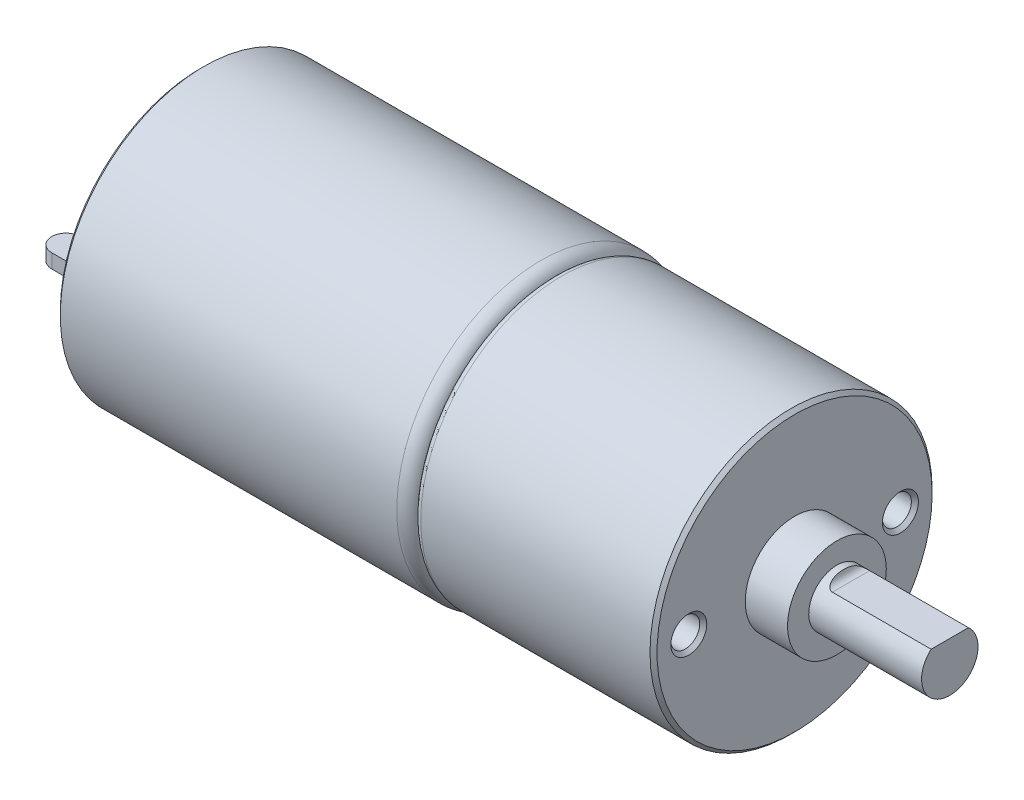
ISO-10303-21;
HEADER;
FILE_DESCRIPTION(('STEP AP214'),'2;1');
FILE_NAME('part.step','',(''),(''),'','','');
FILE_SCHEMA(('AUTOMOTIVE_DESIGN { 1 0 10303 214 1 1 1 1 }'));
ENDSEC;
DATA;
#1=APPLICATION_CONTEXT('core data for automotive mechanical design processes');
#2=APPLICATION_PROTOCOL_DEFINITION('international standard','automotive_design',2000,#1);
#3=PRODUCT_CONTEXT('',#1,'mechanical');
#4=PRODUCT('Part','Part','',(#3));
#5=PRODUCT_RELATED_PRODUCT_CATEGORY('part','',(#4));
#6=PRODUCT_DEFINITION_FORMATION('','',#4);
#7=PRODUCT_DEFINITION_CONTEXT('part definition',#1,'design');
#8=PRODUCT_DEFINITION('design','',#6,#7);
#9=PRODUCT_DEFINITION_SHAPE('','',#8);
#10=(LENGTH_UNIT() NAMED_UNIT(*) SI_UNIT(.MILLI.,.METRE.));
#11=(NAMED_UNIT(*) PLANE_ANGLE_UNIT() SI_UNIT($,.RADIAN.));
#12=(NAMED_UNIT(*) SI_UNIT($,.STERADIAN.) SOLID_ANGLE_UNIT());
#13=UNCERTAINTY_MEASURE_WITH_UNIT(LENGTH_MEASURE(1.E-05),#10,'distance_accuracy_value','');
#14=(GEOMETRIC_REPRESENTATION_CONTEXT(3) GLOBAL_UNCERTAINTY_ASSIGNED_CONTEXT((#13)) GLOBAL_UNIT_ASSIGNED_CONTEXT((#10,
#11,#12)) REPRESENTATION_CONTEXT('',''));
#15=CARTESIAN_POINT('',(0.,0.,0.));
#16=DIRECTION('',(0.,0.,1.));
#17=DIRECTION('',(1.,0.,0.));
#18=AXIS2_PLACEMENT_3D('',#15,#16,#17);
#19=CARTESIAN_POINT('',(0.,0.,0.));
#20=DIRECTION('',(1.,0.,0.));
#21=DIRECTION('',(0.,0.,-1.));
#22=AXIS2_PLACEMENT_3D('',#19,#20,#21);
#23=PLANE('',#22);
#24=DIRECTION('',(0.,-1.,0.));
#25=VECTOR('',#24,1.);
#26=CARTESIAN_POINT('',(0.,0.5,-7.15));
#27=LINE('',#26,#25);
#28=CARTESIAN_POINT('',(0.,0.5,-7.15));
#29=VERTEX_POINT('',#28);
#30=CARTESIAN_POINT('',(0.,-0.5,-7.15));
#31=VERTEX_POINT('',#30);
#32=EDGE_CURVE('E180',#29,#31,#27,.T.);
#33=ORIENTED_EDGE('',*,*,#32,.F.);
#34=DIRECTION('',(0.,0.,-1.));
#35=VECTOR('',#34,1.);
#36=CARTESIAN_POINT('',(0.,0.5,-7.15));
#37=LINE('',#36,#35);
#38=CARTESIAN_POINT('',(0.,0.5,-5.15));
#39=VERTEX_POINT('',#38);
#40=EDGE_CURVE('E192',#39,#29,#37,.T.);
#41=ORIENTED_EDGE('',*,*,#40,.F.);
#42=DIRECTION('',(0.,1.,0.));
#43=VECTOR('',#42,1.);
#44=CARTESIAN_POINT('',(0.,0.5,-5.15));
#45=LINE('',#44,#43);
#46=CARTESIAN_POINT('',(0.,-0.5,-5.15));
#47=VERTEX_POINT('',#46);
#48=EDGE_CURVE('E188',#47,#39,#45,.T.);
#49=ORIENTED_EDGE('',*,*,#48,.F.);
#50=DIRECTION('',(0.,0.,1.));
#51=VECTOR('',#50,1.);
#52=CARTESIAN_POINT('',(0.,-0.5,-7.15));
#53=LINE('',#52,#51);
#54=EDGE_CURVE('E184',#31,#47,#53,.T.);
#55=ORIENTED_EDGE('',*,*,#54,.F.);
#56=EDGE_LOOP('',(#33,#41,#49,#55));
#57=FACE_BOUND('',#56,.T.);
#58=CARTESIAN_POINT('',(0.,0.,0.));
#59=DIRECTION('',(1.,0.,0.));
#60=DIRECTION('',(0.,0.,-1.));
#61=AXIS2_PLACEMENT_3D('',#58,#59,#60);
#62=CIRCLE('',#61,9.95);
#63=CARTESIAN_POINT('',(0.,0.,-9.95));
#64=VERTEX_POINT('',#63);
#65=EDGE_CURVE('E259',#64,#64,#62,.F.);
#66=ORIENTED_EDGE('',*,*,#65,.T.);
#67=EDGE_LOOP('',(#66));
#68=FACE_BOUND('',#67,.T.);
#69=DIRECTION('',(0.,-1.,0.));
#70=VECTOR('',#69,1.);
#71=CARTESIAN_POINT('',(0.,0.5,5.15));
#72=LINE('',#71,#70);
#73=CARTESIAN_POINT('',(0.,0.5,5.15));
#74=VERTEX_POINT('',#73);
#75=CARTESIAN_POINT('',(0.,-0.5,5.15));
#76=VERTEX_POINT('',#75);
#77=EDGE_CURVE('E143',#74,#76,#72,.T.);
#78=ORIENTED_EDGE('',*,*,#77,.F.);
#79=DIRECTION('',(0.,0.,-1.));
#80=VECTOR('',#79,1.);
#81=CARTESIAN_POINT('',(0.,0.5,5.15));
#82=LINE('',#81,#80);
#83=CARTESIAN_POINT('',(0.,0.5,7.15));
#84=VERTEX_POINT('',#83);
#85=EDGE_CURVE('E151',#84,#74,#82,.T.);
#86=ORIENTED_EDGE('',*,*,#85,.F.);
#87=DIRECTION('',(0.,1.,0.));
#88=VECTOR('',#87,1.);
#89=CARTESIAN_POINT('',(0.,0.5,7.15));
#90=LINE('',#89,#88);
#91=CARTESIAN_POINT('',(0.,-0.5,7.15));
#92=VERTEX_POINT('',#91);
#93=EDGE_CURVE('E166',#92,#84,#90,.T.);
#94=ORIENTED_EDGE('',*,*,#93,.F.);
#95=DIRECTION('',(0.,0.,1.));
#96=VECTOR('',#95,1.);
#97=CARTESIAN_POINT('',(0.,-0.5,5.15));
#98=LINE('',#97,#96);
#99=EDGE_CURVE('E159',#76,#92,#98,.T.);
#100=ORIENTED_EDGE('',*,*,#99,.F.);
#101=EDGE_LOOP('',(#78,#86,#94,#100));
#102=FACE_BOUND('',#101,.T.);
#103=ADVANCED_FACE('F45',(#57,#68,#102),#23,.F.);
#104=CARTESIAN_POINT('',(25.1,0.,0.));
#105=DIRECTION('',(-1.,0.,0.));
#106=DIRECTION('',(0.,0.,1.));
#107=AXIS2_PLACEMENT_3D('',#104,#105,#106);
#108=CYLINDRICAL_SURFACE('',#107,10.2);
#109=CARTESIAN_POINT('',(0.249999999999997,0.,0.));
#110=DIRECTION('',(1.,0.,0.));
#111=DIRECTION('',(0.,0.,-1.));
#112=AXIS2_PLACEMENT_3D('',#109,#110,#111);
#113=CIRCLE('',#112,10.2);
#114=CARTESIAN_POINT('',(0.249999999999997,0.,-10.2));
#115=VERTEX_POINT('',#114);
#116=EDGE_CURVE('E283',#115,#115,#113,.T.);
#117=ORIENTED_EDGE('',*,*,#116,.T.);
#118=EDGE_LOOP('',(#117));
#119=FACE_BOUND('',#118,.T.);
#120=CARTESIAN_POINT('',(24.1,0.,0.));
#121=DIRECTION('',(1.,0.,0.));
#122=DIRECTION('',(0.,0.,-1.));
#123=AXIS2_PLACEMENT_3D('',#120,#121,#122);
#124=CIRCLE('',#123,10.2);
#125=CARTESIAN_POINT('',(24.1,0.,-10.2));
#126=VERTEX_POINT('',#125);
#127=EDGE_CURVE('E263',#126,#126,#124,.F.);
#128=ORIENTED_EDGE('',*,*,#127,.T.);
#129=EDGE_LOOP('',(#128));
#130=FACE_BOUND('',#129,.T.);
#131=ADVANCED_FACE('F328',(#119,#130),#108,.T.);
#132=CARTESIAN_POINT('',(24.1,0.,0.));
#133=DIRECTION('',(1.,0.,0.));
#134=DIRECTION('',(0.,0.,-1.));
#135=AXIS2_PLACEMENT_3D('',#132,#133,#134);
#136=TOROIDAL_SURFACE('',#135,9.2,1.);
#137=ORIENTED_EDGE('',*,*,#127,.F.);
#138=EDGE_LOOP('',(#137));
#139=FACE_BOUND('',#138,.T.);
#140=CARTESIAN_POINT('',(25.1,0.,0.));
#141=DIRECTION('',(1.,0.,0.));
#142=DIRECTION('',(0.,0.,-1.));
#143=AXIS2_PLACEMENT_3D('',#140,#141,#142);
#144=CIRCLE('',#143,9.2);
#145=CARTESIAN_POINT('',(25.1,0.,-9.2));
#146=VERTEX_POINT('',#145);
#147=EDGE_CURVE('E253',#146,#146,#144,.T.);
#148=ORIENTED_EDGE('',*,*,#147,.F.);
#149=EDGE_LOOP('',(#148));
#150=FACE_BOUND('',#149,.T.);
#151=ADVANCED_FACE('F334',(#139,#150),#136,.T.);
#152=CARTESIAN_POINT('',(42.1,0.,0.));
#153=DIRECTION('',(-1.,0.,0.));
#154=DIRECTION('',(0.,0.,1.));
#155=AXIS2_PLACEMENT_3D('',#152,#153,#154);
#156=CYLINDRICAL_SURFACE('',#155,10.);
#157=CARTESIAN_POINT('',(41.85,0.,0.));
#158=DIRECTION('',(1.,0.,0.));
#159=DIRECTION('',(0.,0.,-1.));
#160=AXIS2_PLACEMENT_3D('',#157,#158,#159);
#161=CIRCLE('',#160,10.);
#162=CARTESIAN_POINT('',(41.85,0.,-10.));
#163=VERTEX_POINT('',#162);
#164=EDGE_CURVE('E279',#163,#163,#161,.F.);
#165=ORIENTED_EDGE('',*,*,#164,.T.);
#166=EDGE_LOOP('',(#165));
#167=FACE_BOUND('',#166,.T.);
#168=CARTESIAN_POINT('',(25.6,0.,0.));
#169=DIRECTION('',(1.,0.,0.));
#170=DIRECTION('',(0.,0.,-1.));
#171=AXIS2_PLACEMENT_3D('',#168,#169,#170);
#172=CIRCLE('',#171,10.);
#173=CARTESIAN_POINT('',(25.6,0.,-10.));
#174=VERTEX_POINT('',#173);
#175=EDGE_CURVE('E267',#174,#174,#172,.T.);
#176=ORIENTED_EDGE('',*,*,#175,.T.);
#177=EDGE_LOOP('',(#176));
#178=FACE_BOUND('',#177,.T.);
#179=ADVANCED_FACE('F340',(#167,#178),#156,.T.);
#180=CARTESIAN_POINT('',(42.1,0.,0.));
#181=DIRECTION('',(1.,0.,0.));
#182=DIRECTION('',(0.,0.,-1.));
#183=AXIS2_PLACEMENT_3D('',#180,#181,#182);
#184=PLANE('',#183);
#185=CARTESIAN_POINT('',(42.1,0.,7.5));
#186=DIRECTION('',(1.,0.,0.));
#187=DIRECTION('',(0.,0.,-1.));
#188=AXIS2_PLACEMENT_3D('',#185,#186,#187);
#189=CIRCLE('',#188,1.275);
#190=CARTESIAN_POINT('',(42.1,0.,6.225));
#191=VERTEX_POINT('',#190);
#192=EDGE_CURVE('E208',#191,#191,#189,.T.);
#193=ORIENTED_EDGE('',*,*,#192,.F.);
#194=EDGE_LOOP('',(#193));
#195=FACE_BOUND('',#194,.T.);
#196=CARTESIAN_POINT('',(42.1,0.,-7.5));
#197=DIRECTION('',(1.,0.,0.));
#198=DIRECTION('',(0.,0.,-1.));
#199=AXIS2_PLACEMENT_3D('',#196,#197,#198);
#200=CIRCLE('',#199,1.275);
#201=CARTESIAN_POINT('',(42.1,0.,-8.775));
#202=VERTEX_POINT('',#201);
#203=EDGE_CURVE('E220',#202,#202,#200,.T.);
#204=ORIENTED_EDGE('',*,*,#203,.F.);
#205=EDGE_LOOP('',(#204));
#206=FACE_BOUND('',#205,.T.);
#207=CARTESIAN_POINT('',(42.1,0.,0.));
#208=DIRECTION('',(1.,0.,0.));
#209=DIRECTION('',(0.,0.,-1.));
#210=AXIS2_PLACEMENT_3D('',#207,#208,#209);
#211=CIRCLE('',#210,3.5);
#212=CARTESIAN_POINT('',(42.1,0.,-3.5));
#213=VERTEX_POINT('',#212);
#214=EDGE_CURVE('E254',#213,#213,#211,.T.);
#215=ORIENTED_EDGE('',*,*,#214,.F.);
#216=EDGE_LOOP('',(#215));
#217=FACE_BOUND('',#216,.T.);
#218=CARTESIAN_POINT('',(42.1,0.,0.));
#219=DIRECTION('',(1.,0.,0.));
#220=DIRECTION('',(0.,0.,-1.));
#221=AXIS2_PLACEMENT_3D('',#218,#219,#220);
#222=CIRCLE('',#221,9.74999999999999);
#223=CARTESIAN_POINT('',(42.1,0.,-9.74999999999999));
#224=VERTEX_POINT('',#223);
#225=EDGE_CURVE('E275',#224,#224,#222,.T.);
#226=ORIENTED_EDGE('',*,*,#225,.T.);
#227=EDGE_LOOP('',(#226));
#228=FACE_BOUND('',#227,.T.);
#229=ADVANCED_FACE('F491',(#195,#206,#217,#228),#184,.T.);
#230=CARTESIAN_POINT('',(25.1,0.,0.));
#231=DIRECTION('',(1.,0.,0.));
#232=DIRECTION('',(0.,0.,-1.));
#233=AXIS2_PLACEMENT_3D('',#230,#231,#232);
#234=PLANE('',#233);
#235=CARTESIAN_POINT('',(25.1,0.,0.));
#236=DIRECTION('',(1.,0.,0.));
#237=DIRECTION('',(0.,0.,-1.));
#238=AXIS2_PLACEMENT_3D('',#235,#236,#237);
#239=CIRCLE('',#238,9.5);
#240=CARTESIAN_POINT('',(25.1,0.,-9.5));
#241=VERTEX_POINT('',#240);
#242=EDGE_CURVE('E271',#241,#241,#239,.F.);
#243=ORIENTED_EDGE('',*,*,#242,.T.);
#244=EDGE_LOOP('',(#243));
#245=FACE_BOUND('',#244,.T.);
#246=ORIENTED_EDGE('',*,*,#147,.T.);
#247=EDGE_LOOP('',(#246));
#248=FACE_BOUND('',#247,.T.);
#249=ADVANCED_FACE('F350',(#245,#248),#234,.F.);
#250=CARTESIAN_POINT('',(25.6,0.,0.));
#251=DIRECTION('',(1.,0.,0.));
#252=DIRECTION('',(0.,0.,-1.));
#253=AXIS2_PLACEMENT_3D('',#250,#251,#252);
#254=TOROIDAL_SURFACE('',#253,9.5,0.5);
#255=ORIENTED_EDGE('',*,*,#242,.F.);
#256=EDGE_LOOP('',(#255));
#257=FACE_BOUND('',#256,.T.);
#258=ORIENTED_EDGE('',*,*,#175,.F.);
#259=EDGE_LOOP('',(#258));
#260=FACE_BOUND('',#259,.T.);
#261=ADVANCED_FACE('F346',(#257,#260),#254,.T.);
#262=CARTESIAN_POINT('',(42.1,0.,0.));
#263=DIRECTION('',(-1.,0.,0.));
#264=DIRECTION('',(0.,0.,1.));
#265=AXIS2_PLACEMENT_3D('',#262,#263,#264);
#266=CONICAL_SURFACE('',#265,9.74999999999999,0.785398163397445);
#267=ORIENTED_EDGE('',*,*,#164,.F.);
#268=EDGE_LOOP('',(#267));
#269=FACE_BOUND('',#268,.T.);
#270=ORIENTED_EDGE('',*,*,#225,.F.);
#271=EDGE_LOOP('',(#270));
#272=FACE_BOUND('',#271,.T.);
#273=ADVANCED_FACE('F349',(#269,#272),#266,.T.);
#274=CARTESIAN_POINT('',(0.249999999999997,0.,0.));
#275=DIRECTION('',(1.,0.,0.));
#276=DIRECTION('',(0.,0.,-1.));
#277=AXIS2_PLACEMENT_3D('',#274,#275,#276);
#278=CONICAL_SURFACE('',#277,10.2,0.785398163397452);
#279=ORIENTED_EDGE('',*,*,#65,.F.);
#280=EDGE_LOOP('',(#279));
#281=FACE_BOUND('',#280,.T.);
#282=ORIENTED_EDGE('',*,*,#116,.F.);
#283=EDGE_LOOP('',(#282));
#284=FACE_BOUND('',#283,.T.);
#285=ADVANCED_FACE('F358',(#281,#284),#278,.T.);
#286=CARTESIAN_POINT('',(45.1,0.,0.));
#287=DIRECTION('',(-1.,0.,0.));
#288=DIRECTION('',(0.,0.,1.));
#289=AXIS2_PLACEMENT_3D('',#286,#287,#288);
#290=CYLINDRICAL_SURFACE('',#289,3.5);
#291=CARTESIAN_POINT('',(45.1,0.,0.));
#292=DIRECTION('',(1.,0.,0.));
#293=DIRECTION('',(0.,0.,-1.));
#294=AXIS2_PLACEMENT_3D('',#291,#292,#293);
#295=CIRCLE('',#294,3.5);
#296=CARTESIAN_POINT('',(45.1,0.,-3.5));
#297=VERTEX_POINT('',#296);
#298=EDGE_CURVE('E249',#297,#297,#295,.T.);
#299=ORIENTED_EDGE('',*,*,#298,.F.);
#300=EDGE_LOOP('',(#299));
#301=FACE_BOUND('',#300,.T.);
#302=ORIENTED_EDGE('',*,*,#214,.T.);
#303=EDGE_LOOP('',(#302));
#304=FACE_BOUND('',#303,.T.);
#305=ADVANCED_FACE('F364',(#301,#304),#290,.T.);
#306=CARTESIAN_POINT('',(45.1,0.,0.));
#307=DIRECTION('',(1.,0.,0.));
#308=DIRECTION('',(0.,0.,-1.));
#309=AXIS2_PLACEMENT_3D('',#306,#307,#308);
#310=PLANE('',#309);
#311=CARTESIAN_POINT('',(45.1,0.,0.));
#312=DIRECTION('',(1.,0.,0.));
#313=DIRECTION('',(0.,0.,-1.));
#314=AXIS2_PLACEMENT_3D('',#311,#312,#313);
#315=CIRCLE('',#314,2.);
#316=CARTESIAN_POINT('',(45.1,0.,-2.));
#317=VERTEX_POINT('',#316);
#318=EDGE_CURVE('E248',#317,#317,#315,.F.);
#319=ORIENTED_EDGE('',*,*,#318,.T.);
#320=EDGE_LOOP('',(#319));
#321=FACE_BOUND('',#320,.T.);
#322=ORIENTED_EDGE('',*,*,#298,.T.);
#323=EDGE_LOOP('',(#322));
#324=FACE_BOUND('',#323,.T.);
#325=ADVANCED_FACE('F324',(#321,#324),#310,.T.);
#326=CARTESIAN_POINT('',(53.1,0.,0.));
#327=DIRECTION('',(-1.,0.,0.));
#328=DIRECTION('',(0.,0.,1.));
#329=AXIS2_PLACEMENT_3D('',#326,#327,#328);
#330=CYLINDRICAL_SURFACE('',#329,2.);
#331=ORIENTED_EDGE('',*,*,#318,.F.);
#332=EDGE_LOOP('',(#331));
#333=FACE_BOUND('',#332,.T.);
#334=CARTESIAN_POINT('',(53.1,0.,0.));
#335=DIRECTION('',(1.,0.,0.));
#336=DIRECTION('',(0.,0.,-1.));
#337=AXIS2_PLACEMENT_3D('',#334,#335,#336);
#338=CIRCLE('',#337,2.);
#339=CARTESIAN_POINT('',(53.1,1.5,1.3228756555323));
#340=VERTEX_POINT('',#339);
#341=CARTESIAN_POINT('',(53.1,1.5,-1.32287565553229));
#342=VERTEX_POINT('',#341);
#343=EDGE_CURVE('E244',#340,#342,#338,.T.);
#344=ORIENTED_EDGE('',*,*,#343,.F.);
#345=DIRECTION('',(-1.,0.,0.));
#346=VECTOR('',#345,1.);
#347=CARTESIAN_POINT('',(53.1,1.5,1.3228756555323));
#348=LINE('',#347,#346);
#349=CARTESIAN_POINT('',(46.1,1.5,1.32287565553229));
#350=VERTEX_POINT('',#349);
#351=EDGE_CURVE('E240',#340,#350,#348,.T.);
#352=ORIENTED_EDGE('',*,*,#351,.T.);
#353=CARTESIAN_POINT('',(46.1,1.5,1.3228756555323));
#354=CARTESIAN_POINT('',(46.0791676048181,1.49996270829361,1.32290249420377));
#355=CARTESIAN_POINT('',(46.0583774712538,1.5012996776808,1.32140225414852));
#356=CARTESIAN_POINT('',(46.0176633992575,1.50641290602934,1.31557799865092));
#357=CARTESIAN_POINT('',(45.9977340385252,1.51017036959621,1.31127573837705));
#358=CARTESIAN_POINT('',(45.9592225738211,1.5198142182921,1.30008279941611));
#359=CARTESIAN_POINT('',(45.940637883934,1.52569637937861,1.29319725542917));
#360=CARTESIAN_POINT('',(45.9051162884324,1.5391512831788,1.27715462877048));
#361=CARTESIAN_POINT('',(45.8881823959056,1.54672703708844,1.26799349685521));
#362=CARTESIAN_POINT('',(45.8506567353127,1.56593470640666,1.24424761482085));
#363=CARTESIAN_POINT('',(45.830815513438,1.57806473672201,1.2288817808771));
#364=CARTESIAN_POINT('',(45.7945122350983,1.60355160648134,1.19543615521496));
#365=CARTESIAN_POINT('',(45.7780561587593,1.61691055769274,1.17735165663688));
#366=CARTESIAN_POINT('',(45.7410811262295,1.6506133129931,1.12989973646012));
#367=CARTESIAN_POINT('',(45.7224154280413,1.67122598684686,1.09928938512504));
#368=CARTESIAN_POINT('',(45.6905948442696,1.71180790590734,1.03497435795543));
#369=CARTESIAN_POINT('',(45.6774511772054,1.7317757659124,1.00126355089678));
#370=CARTESIAN_POINT('',(45.6569802954824,1.76742323512638,0.936683318997856));
#371=CARTESIAN_POINT('',(45.6490896000934,1.78330739197099,0.906098595528337));
#372=CARTESIAN_POINT('',(45.6357256085982,1.8136581226407,0.843712563142041));
#373=CARTESIAN_POINT('',(45.630254049664,1.8281236719877,0.811910397733955));
#374=CARTESIAN_POINT('',(45.6165530086807,1.86915286590439,0.71497215597942));
#375=CARTESIAN_POINT('',(45.6110655074245,1.89329072603512,0.648409297327984));
#376=CARTESIAN_POINT('',(45.6047067881272,1.9297286656087,0.528353340784739));
#377=CARTESIAN_POINT('',(45.6030718092089,1.94347154559898,0.475312314202791));
#378=CARTESIAN_POINT('',(45.6009824735348,1.96657218874064,0.368226654670982));
#379=CARTESIAN_POINT('',(45.6005286562206,1.97592794667592,0.314181574509483));
#380=CARTESIAN_POINT('',(45.6000460868047,1.99017285948387,0.205476388621387));
#381=CARTESIAN_POINT('',(45.6000175901701,1.99505932824247,0.150815932993623));
#382=CARTESIAN_POINT('',(45.5999930623057,2.0003249582883,0.041289255187699));
#383=CARTESIAN_POINT('',(45.5999970240911,2.00070508925144,-0.0135769201816983));
#384=CARTESIAN_POINT('',(45.6000057598513,1.99693497650901,-0.12380697291298));
#385=CARTESIAN_POINT('',(45.6000105429255,1.99273079621824,-0.179169008437155));
#386=CARTESIAN_POINT('',(45.6003686482253,1.97973307110601,-0.289372156267123));
#387=CARTESIAN_POINT('',(45.6007220962038,1.97093787098128,-0.344213073416018));
#388=CARTESIAN_POINT('',(45.6024997215303,1.94885454708979,-0.452798486259084));
#389=CARTESIAN_POINT('',(45.6039206925356,1.9355799430059,-0.506545771189119));
#390=CARTESIAN_POINT('',(45.6089235585044,1.90465921593685,-0.612633932835227));
#391=CARTESIAN_POINT('',(45.6125034850658,1.88701708362049,-0.664976045349146));
#392=CARTESIAN_POINT('',(45.6226480931905,1.85016240475368,-0.761046514597283));
#393=CARTESIAN_POINT('',(45.6287653993129,1.83145036695579,-0.805011532569508));
#394=CARTESIAN_POINT('',(45.6451623181654,1.79120346558065,-0.890977617531939));
#395=CARTESIAN_POINT('',(45.6554492486227,1.76966368445761,-0.932975086145193));
#396=CARTESIAN_POINT('',(45.6821188043515,1.72416297852539,-1.01463260895081));
#397=CARTESIAN_POINT('',(45.6985965829306,1.70016875285907,-1.0542443498618));
#398=CARTESIAN_POINT('',(45.7398383699762,1.65174268284699,-1.1285726625121));
#399=CARTESIAN_POINT('',(45.7645514928599,1.62731437728351,-1.16331747857783));
#400=CARTESIAN_POINT('',(45.8088959316785,1.59306647210002,-1.20934125653485));
#401=CARTESIAN_POINT('',(45.8246673011653,1.58216243347284,-1.22353649858872));
#402=CARTESIAN_POINT('',(45.8587440303048,1.5616038670198,-1.24966657630222));
#403=CARTESIAN_POINT('',(45.8770494067039,1.55194934745248,-1.26160139702212));
#404=CARTESIAN_POINT('',(45.916273039465,1.53447886420174,-1.28279655804064));
#405=CARTESIAN_POINT('',(45.9372175597173,1.52668404930056,-1.29202638371135));
#406=CARTESIAN_POINT('',(45.9810638358131,1.51381887123397,-1.30707768906668));
#407=CARTESIAN_POINT('',(46.0039604476192,1.50874158942976,-1.31290782752668));
#408=CARTESIAN_POINT('',(46.0392960805606,1.50355156446553,-1.31884014315598));
#409=CARTESIAN_POINT('',(46.0513420459941,1.50222528495455,-1.32034921305609));
#410=CARTESIAN_POINT('',(46.0755885837809,1.50044785403216,-1.3223679528762));
#411=CARTESIAN_POINT('',(46.0877892474329,1.49999724616737,-1.32287700206577));
#412=CARTESIAN_POINT('',(46.1,1.5,-1.3228756555323));
#413=B_SPLINE_CURVE_WITH_KNOTS('',3,(#353,#354,#355,#356,#357,#358,#359,#360,#361,#362,#363,
#364,#365,#366,#367,#368,#369,#370,#371,#372,#373,#374,#375,#376,#377,#378,#379,#380,#381,#382,
#383,#384,#385,#386,#387,#388,#389,#390,#391,#392,#393,#394,#395,#396,#397,#398,#399,#400,#401,
#402,#403,#404,#405,#406,#407,#408,#409,#410,#411,#412),.UNSPECIFIED.,.F.,.F.,(4,2,2,2,2,2,2,2,
2,2,2,2,2,2,2,2,2,2,2,2,2,2,2,2,2,2,2,2,2,4),(0.,0.0623335339048153,0.124188782310098,
0.185921729085364,0.247765322113473,0.33092148753271,0.414223316644069,0.53759480450994,
0.661215734984689,0.767128608245249,0.873117414064848,1.08546121459961,1.24973964330858,
1.41409308553004,1.57854524200633,1.74296201094727,1.90933429979707,2.07576661605284,
2.24170103564787,2.40748439475189,2.55176434443078,2.69629861068146,2.8431518332843,
2.98911398483377,3.06046318830158,3.13181286331879,3.20393890799786,3.27588044094045,
3.31245211312006,3.34904647881489),.UNSPECIFIED.);
#414=CARTESIAN_POINT('',(46.1,1.5,-1.32287565553229));
#415=VERTEX_POINT('',#414);
#416=EDGE_CURVE('E295',#350,#415,#413,.T.);
#417=ORIENTED_EDGE('',*,*,#416,.T.);
#418=DIRECTION('',(-1.,0.,0.));
#419=VECTOR('',#418,1.);
#420=CARTESIAN_POINT('',(53.1,1.5,-1.3228756555323));
#421=LINE('',#420,#419);
#422=EDGE_CURVE('E236',#415,#342,#421,.F.);
#423=ORIENTED_EDGE('',*,*,#422,.T.);
#424=EDGE_LOOP('',(#344,#352,#417,#423));
#425=FACE_BOUND('',#424,.T.);
#426=ADVANCED_FACE('F307',(#333,#425),#330,.T.);
#427=CARTESIAN_POINT('',(53.1,0.,0.));
#428=DIRECTION('',(1.,0.,0.));
#429=DIRECTION('',(0.,0.,-1.));
#430=AXIS2_PLACEMENT_3D('',#427,#428,#429);
#431=PLANE('',#430);
#432=DIRECTION('',(0.,0.,-1.));
#433=VECTOR('',#432,1.);
#434=CARTESIAN_POINT('',(53.1,1.5,0.));
#435=LINE('',#434,#433);
#436=EDGE_CURVE('E258',#340,#342,#435,.T.);
#437=ORIENTED_EDGE('',*,*,#436,.F.);
#438=ORIENTED_EDGE('',*,*,#343,.T.);
#439=EDGE_LOOP('',(#437,#438));
#440=FACE_BOUND('',#439,.T.);
#441=ADVANCED_FACE('F316',(#440),#431,.T.);
#442=CARTESIAN_POINT('',(46.1,2.,-10.2));
#443=DIRECTION('',(0.,0.,1.));
#444=DIRECTION('',(1.,0.,0.));
#445=AXIS2_PLACEMENT_3D('',#442,#443,#444);
#446=CYLINDRICAL_SURFACE('',#445,0.5);
#447=DIRECTION('',(0.,0.,1.));
#448=VECTOR('',#447,1.);
#449=CARTESIAN_POINT('',(46.1,1.5,-10.2));
#450=LINE('',#449,#448);
#451=EDGE_CURVE('E232',#415,#350,#450,.T.);
#452=ORIENTED_EDGE('',*,*,#451,.F.);
#453=ORIENTED_EDGE('',*,*,#416,.F.);
#454=EDGE_LOOP('',(#452,#453));
#455=FACE_BOUND('',#454,.T.);
#456=ADVANCED_FACE('F311',(#455),#446,.F.);
#457=CARTESIAN_POINT('',(53.1,1.5,-10.2));
#458=DIRECTION('',(0.,-1.,0.));
#459=DIRECTION('',(1.,0.,0.));
#460=AXIS2_PLACEMENT_3D('',#457,#458,#459);
#461=PLANE('',#460);
#462=ORIENTED_EDGE('',*,*,#436,.T.);
#463=ORIENTED_EDGE('',*,*,#422,.F.);
#464=ORIENTED_EDGE('',*,*,#451,.T.);
#465=ORIENTED_EDGE('',*,*,#351,.F.);
#466=EDGE_LOOP('',(#462,#463,#464,#465));
#467=FACE_BOUND('',#466,.T.);
#468=ADVANCED_FACE('F315',(#467),#461,.F.);
#469=CARTESIAN_POINT('',(37.1,0.,-7.5));
#470=DIRECTION('',(1.,0.,0.));
#471=DIRECTION('',(0.,0.,-1.));
#472=AXIS2_PLACEMENT_3D('',#469,#470,#471);
#473=CONICAL_SURFACE('',#472,1.02499999999999,1.02974425867665);
#474=CARTESIAN_POINT('',(36.4841178654968,0.,-7.5));
#475=VERTEX_POINT('',#474);
#476=VERTEX_LOOP('',#475);
#477=FACE_BOUND('',#476,.T.);
#478=CARTESIAN_POINT('',(37.1,0.,-7.5));
#479=DIRECTION('',(1.,0.,0.));
#480=DIRECTION('',(0.,0.,-1.));
#481=AXIS2_PLACEMENT_3D('',#478,#479,#480);
#482=CIRCLE('',#481,1.02499999999999);
#483=CARTESIAN_POINT('',(37.1,0.,-8.525));
#484=VERTEX_POINT('',#483);
#485=EDGE_CURVE('E228',#484,#484,#482,.T.);
#486=ORIENTED_EDGE('',*,*,#485,.T.);
#487=EDGE_LOOP('',(#486));
#488=FACE_BOUND('',#487,.T.);
#489=ADVANCED_FACE('F476',(#477,#488),#473,.F.);
#490=CARTESIAN_POINT('',(42.1,0.,-7.5));
#491=DIRECTION('',(1.,0.,0.));
#492=DIRECTION('',(0.,0.,-1.));
#493=AXIS2_PLACEMENT_3D('',#490,#491,#492);
#494=CYLINDRICAL_SURFACE('',#493,1.02499999999999);
#495=ORIENTED_EDGE('',*,*,#485,.F.);
#496=EDGE_LOOP('',(#495));
#497=FACE_BOUND('',#496,.T.);
#498=CARTESIAN_POINT('',(41.85,0.,-7.5));
#499=DIRECTION('',(1.,0.,0.));
#500=DIRECTION('',(0.,0.,-1.));
#501=AXIS2_PLACEMENT_3D('',#498,#499,#500);
#502=CIRCLE('',#501,1.02499999999999);
#503=CARTESIAN_POINT('',(41.85,0.,-8.525));
#504=VERTEX_POINT('',#503);
#505=EDGE_CURVE('E224',#504,#504,#502,.T.);
#506=ORIENTED_EDGE('',*,*,#505,.T.);
#507=EDGE_LOOP('',(#506));
#508=FACE_BOUND('',#507,.T.);
#509=ADVANCED_FACE('F473',(#497,#508),#494,.F.);
#510=CARTESIAN_POINT('',(42.1,0.,-7.5));
#511=DIRECTION('',(1.,0.,0.));
#512=DIRECTION('',(0.,0.,-1.));
#513=AXIS2_PLACEMENT_3D('',#510,#511,#512);
#514=CONICAL_SURFACE('',#513,1.275,0.785398163397459);
#515=ORIENTED_EDGE('',*,*,#505,.F.);
#516=EDGE_LOOP('',(#515));
#517=FACE_BOUND('',#516,.T.);
#518=ORIENTED_EDGE('',*,*,#203,.T.);
#519=EDGE_LOOP('',(#518));
#520=FACE_BOUND('',#519,.T.);
#521=ADVANCED_FACE('F469',(#517,#520),#514,.F.);
#522=CARTESIAN_POINT('',(37.1,0.,7.5));
#523=DIRECTION('',(1.,0.,0.));
#524=DIRECTION('',(0.,0.,-1.));
#525=AXIS2_PLACEMENT_3D('',#522,#523,#524);
#526=CONICAL_SURFACE('',#525,1.02499999999999,1.02974425867665);
#527=CARTESIAN_POINT('',(36.4841178654968,0.,7.5));
#528=VERTEX_POINT('',#527);
#529=VERTEX_LOOP('',#528);
#530=FACE_BOUND('',#529,.T.);
#531=CARTESIAN_POINT('',(37.1,0.,7.5));
#532=DIRECTION('',(1.,0.,0.));
#533=DIRECTION('',(0.,0.,-1.));
#534=AXIS2_PLACEMENT_3D('',#531,#532,#533);
#535=CIRCLE('',#534,1.02499999999999);
#536=CARTESIAN_POINT('',(37.1,0.,6.47500000000001));
#537=VERTEX_POINT('',#536);
#538=EDGE_CURVE('E216',#537,#537,#535,.T.);
#539=ORIENTED_EDGE('',*,*,#538,.T.);
#540=EDGE_LOOP('',(#539));
#541=FACE_BOUND('',#540,.T.);
#542=ADVANCED_FACE('F465',(#530,#541),#526,.F.);
#543=CARTESIAN_POINT('',(42.1,0.,7.5));
#544=DIRECTION('',(1.,0.,0.));
#545=DIRECTION('',(0.,0.,-1.));
#546=AXIS2_PLACEMENT_3D('',#543,#544,#545);
#547=CYLINDRICAL_SURFACE('',#546,1.02499999999999);
#548=ORIENTED_EDGE('',*,*,#538,.F.);
#549=EDGE_LOOP('',(#548));
#550=FACE_BOUND('',#549,.T.);
#551=CARTESIAN_POINT('',(41.85,0.,7.5));
#552=DIRECTION('',(1.,0.,0.));
#553=DIRECTION('',(0.,0.,-1.));
#554=AXIS2_PLACEMENT_3D('',#551,#552,#553);
#555=CIRCLE('',#554,1.02499999999999);
#556=CARTESIAN_POINT('',(41.85,0.,6.475));
#557=VERTEX_POINT('',#556);
#558=EDGE_CURVE('E212',#557,#557,#555,.T.);
#559=ORIENTED_EDGE('',*,*,#558,.T.);
#560=EDGE_LOOP('',(#559));
#561=FACE_BOUND('',#560,.T.);
#562=ADVANCED_FACE('F461',(#550,#561),#547,.F.);
#563=CARTESIAN_POINT('',(42.1,0.,7.5));
#564=DIRECTION('',(1.,0.,0.));
#565=DIRECTION('',(0.,0.,-1.));
#566=AXIS2_PLACEMENT_3D('',#563,#564,#565);
#567=CONICAL_SURFACE('',#566,1.275,0.785398163397459);
#568=ORIENTED_EDGE('',*,*,#558,.F.);
#569=EDGE_LOOP('',(#568));
#570=FACE_BOUND('',#569,.T.);
#571=ORIENTED_EDGE('',*,*,#192,.T.);
#572=EDGE_LOOP('',(#571));
#573=FACE_BOUND('',#572,.T.);
#574=ADVANCED_FACE('F458',(#570,#573),#567,.F.);
#575=CARTESIAN_POINT('',(-4.4,0.5,-7.15));
#576=DIRECTION('',(0.,0.,1.));
#577=DIRECTION('',(1.,0.,0.));
#578=AXIS2_PLACEMENT_3D('',#575,#576,#577);
#579=PLANE('',#578);
#580=DIRECTION('',(1.,0.,0.));
#581=VECTOR('',#580,1.);
#582=CARTESIAN_POINT('',(-4.4,-0.5,-7.15));
#583=LINE('',#582,#581);
#584=CARTESIAN_POINT('',(-3.4,-0.5,-7.15));
#585=VERTEX_POINT('',#584);
#586=EDGE_CURVE('E205',#585,#31,#583,.T.);
#587=ORIENTED_EDGE('',*,*,#586,.F.);
#588=DIRECTION('',(0.,-1.,0.));
#589=VECTOR('',#588,1.);
#590=CARTESIAN_POINT('',(-3.4,0.5,-7.15));
#591=LINE('',#590,#589);
#592=CARTESIAN_POINT('',(-3.4,0.5,-7.15));
#593=VERTEX_POINT('',#592);
#594=EDGE_CURVE('E11',#585,#593,#591,.F.);
#595=ORIENTED_EDGE('',*,*,#594,.T.);
#596=DIRECTION('',(1.,0.,0.));
#597=VECTOR('',#596,1.);
#598=CARTESIAN_POINT('',(-4.4,0.5,-7.15));
#599=LINE('',#598,#597);
#600=EDGE_CURVE('E196',#593,#29,#599,.T.);
#601=ORIENTED_EDGE('',*,*,#600,.T.);
#602=ORIENTED_EDGE('',*,*,#32,.T.);
#603=EDGE_LOOP('',(#587,#595,#601,#602));
#604=FACE_BOUND('',#603,.T.);
#605=ADVANCED_FACE('F399',(#604),#579,.F.);
#606=CARTESIAN_POINT('',(-4.4,-0.5,-7.15));
#607=DIRECTION('',(0.,1.,0.));
#608=DIRECTION('',(0.,0.,1.));
#609=AXIS2_PLACEMENT_3D('',#606,#607,#608);
#610=PLANE('',#609);
#611=DIRECTION('',(1.,0.,0.));
#612=VECTOR('',#611,1.);
#613=CARTESIAN_POINT('',(-4.4,-0.5,-5.15));
#614=LINE('',#613,#612);
#615=CARTESIAN_POINT('',(-3.4,-0.5,-5.15));
#616=VERTEX_POINT('',#615);
#617=EDGE_CURVE('E202',#616,#47,#614,.T.);
#618=ORIENTED_EDGE('',*,*,#617,.F.);
#619=CARTESIAN_POINT('',(-3.4,-0.5,-6.15));
#620=DIRECTION('',(0.,1.,0.));
#621=DIRECTION('',(0.,0.,1.));
#622=AXIS2_PLACEMENT_3D('',#619,#620,#621);
#623=CIRCLE('',#622,1.);
#624=CARTESIAN_POINT('',(-4.4,-0.5,-6.15));
#625=VERTEX_POINT('',#624);
#626=EDGE_CURVE('E55',#616,#625,#623,.F.);
#627=ORIENTED_EDGE('',*,*,#626,.T.);
#628=CARTESIAN_POINT('',(-3.4,-0.5,-6.15));
#629=DIRECTION('',(0.,1.,0.));
#630=DIRECTION('',(0.,0.,1.));
#631=AXIS2_PLACEMENT_3D('',#628,#629,#630);
#632=CIRCLE('',#631,1.);
#633=EDGE_CURVE('E63',#625,#585,#632,.F.);
#634=ORIENTED_EDGE('',*,*,#633,.T.);
#635=ORIENTED_EDGE('',*,*,#586,.T.);
#636=ORIENTED_EDGE('',*,*,#54,.T.);
#637=EDGE_LOOP('',(#618,#627,#634,#635,#636));
#638=FACE_BOUND('',#637,.T.);
#639=ADVANCED_FACE('F395',(#638),#610,.F.);
#640=CARTESIAN_POINT('',(-4.4,0.5,-5.15));
#641=DIRECTION('',(0.,0.,-1.));
#642=DIRECTION('',(-1.,0.,0.));
#643=AXIS2_PLACEMENT_3D('',#640,#641,#642);
#644=PLANE('',#643);
#645=DIRECTION('',(1.,0.,0.));
#646=VECTOR('',#645,1.);
#647=CARTESIAN_POINT('',(-4.4,0.5,-5.15));
#648=LINE('',#647,#646);
#649=CARTESIAN_POINT('',(-3.4,0.5,-5.15));
#650=VERTEX_POINT('',#649);
#651=EDGE_CURVE('E199',#650,#39,#648,.T.);
#652=ORIENTED_EDGE('',*,*,#651,.F.);
#653=DIRECTION('',(0.,1.,0.));
#654=VECTOR('',#653,1.);
#655=CARTESIAN_POINT('',(-3.4,-0.5,-5.15));
#656=LINE('',#655,#654);
#657=EDGE_CURVE('E384',#650,#616,#656,.F.);
#658=ORIENTED_EDGE('',*,*,#657,.T.);
#659=ORIENTED_EDGE('',*,*,#617,.T.);
#660=ORIENTED_EDGE('',*,*,#48,.T.);
#661=EDGE_LOOP('',(#652,#658,#659,#660));
#662=FACE_BOUND('',#661,.T.);
#663=ADVANCED_FACE('F390',(#662),#644,.F.);
#664=CARTESIAN_POINT('',(-4.4,0.5,-7.15));
#665=DIRECTION('',(0.,-1.,0.));
#666=DIRECTION('',(0.,0.,-1.));
#667=AXIS2_PLACEMENT_3D('',#664,#665,#666);
#668=PLANE('',#667);
#669=CARTESIAN_POINT('',(-3.4,0.5,-6.15));
#670=DIRECTION('',(0.,-1.,0.));
#671=DIRECTION('',(0.,0.,-1.));
#672=AXIS2_PLACEMENT_3D('',#669,#670,#671);
#673=CIRCLE('',#672,1.);
#674=CARTESIAN_POINT('',(-4.4,0.5,-6.15));
#675=VERTEX_POINT('',#674);
#676=EDGE_CURVE('E405',#593,#675,#673,.F.);
#677=ORIENTED_EDGE('',*,*,#676,.T.);
#678=CARTESIAN_POINT('',(-3.4,0.5,-6.15));
#679=DIRECTION('',(0.,-1.,0.));
#680=DIRECTION('',(0.,0.,-1.));
#681=AXIS2_PLACEMENT_3D('',#678,#679,#680);
#682=CIRCLE('',#681,1.);
#683=EDGE_CURVE('E393',#675,#650,#682,.F.);
#684=ORIENTED_EDGE('',*,*,#683,.T.);
#685=ORIENTED_EDGE('',*,*,#651,.T.);
#686=ORIENTED_EDGE('',*,*,#40,.T.);
#687=ORIENTED_EDGE('',*,*,#600,.F.);
#688=EDGE_LOOP('',(#677,#684,#685,#686,#687));
#689=FACE_BOUND('',#688,.T.);
#690=ADVANCED_FACE('F404',(#689),#668,.F.);
#691=CARTESIAN_POINT('',(-4.4,0.5,5.15));
#692=DIRECTION('',(0.,0.,1.));
#693=DIRECTION('',(1.,0.,0.));
#694=AXIS2_PLACEMENT_3D('',#691,#692,#693);
#695=PLANE('',#694);
#696=DIRECTION('',(1.,0.,0.));
#697=VECTOR('',#696,1.);
#698=CARTESIAN_POINT('',(-4.4,-0.5,5.15));
#699=LINE('',#698,#697);
#700=CARTESIAN_POINT('',(-3.4,-0.5,5.15));
#701=VERTEX_POINT('',#700);
#702=EDGE_CURVE('E177',#701,#76,#699,.T.);
#703=ORIENTED_EDGE('',*,*,#702,.F.);
#704=DIRECTION('',(0.,-1.,0.));
#705=VECTOR('',#704,1.);
#706=CARTESIAN_POINT('',(-3.4,0.5,5.15));
#707=LINE('',#706,#705);
#708=CARTESIAN_POINT('',(-3.4,0.5,5.15));
#709=VERTEX_POINT('',#708);
#710=EDGE_CURVE('E145',#701,#709,#707,.F.);
#711=ORIENTED_EDGE('',*,*,#710,.T.);
#712=DIRECTION('',(1.,0.,0.));
#713=VECTOR('',#712,1.);
#714=CARTESIAN_POINT('',(-4.4,0.5,5.15));
#715=LINE('',#714,#713);
#716=EDGE_CURVE('E139',#709,#74,#715,.T.);
#717=ORIENTED_EDGE('',*,*,#716,.T.);
#718=ORIENTED_EDGE('',*,*,#77,.T.);
#719=EDGE_LOOP('',(#703,#711,#717,#718));
#720=FACE_BOUND('',#719,.T.);
#721=ADVANCED_FACE('F142',(#720),#695,.F.);
#722=CARTESIAN_POINT('',(-4.4,-0.5,5.15));
#723=DIRECTION('',(0.,1.,0.));
#724=DIRECTION('',(0.,0.,1.));
#725=AXIS2_PLACEMENT_3D('',#722,#723,#724);
#726=PLANE('',#725);
#727=DIRECTION('',(1.,0.,0.));
#728=VECTOR('',#727,1.);
#729=CARTESIAN_POINT('',(-4.4,-0.5,7.15));
#730=LINE('',#729,#728);
#731=CARTESIAN_POINT('',(-3.4,-0.5,7.15));
#732=VERTEX_POINT('',#731);
#733=EDGE_CURVE('E174',#732,#92,#730,.T.);
#734=ORIENTED_EDGE('',*,*,#733,.F.);
#735=CARTESIAN_POINT('',(-3.4,-0.5,6.15));
#736=DIRECTION('',(0.,1.,0.));
#737=DIRECTION('',(0.,0.,1.));
#738=AXIS2_PLACEMENT_3D('',#735,#736,#737);
#739=CIRCLE('',#738,1.);
#740=CARTESIAN_POINT('',(-4.4,-0.5,6.15));
#741=VERTEX_POINT('',#740);
#742=EDGE_CURVE('E411',#732,#741,#739,.F.);
#743=ORIENTED_EDGE('',*,*,#742,.T.);
#744=CARTESIAN_POINT('',(-3.4,-0.5,6.15));
#745=DIRECTION('',(0.,1.,0.));
#746=DIRECTION('',(0.,0.,1.));
#747=AXIS2_PLACEMENT_3D('',#744,#745,#746);
#748=CIRCLE('',#747,1.);
#749=EDGE_CURVE('E425',#741,#701,#748,.F.);
#750=ORIENTED_EDGE('',*,*,#749,.T.);
#751=ORIENTED_EDGE('',*,*,#702,.T.);
#752=ORIENTED_EDGE('',*,*,#99,.T.);
#753=EDGE_LOOP('',(#734,#743,#750,#751,#752));
#754=FACE_BOUND('',#753,.T.);
#755=ADVANCED_FACE('F438',(#754),#726,.F.);
#756=CARTESIAN_POINT('',(-4.4,0.5,7.15));
#757=DIRECTION('',(0.,0.,-1.));
#758=DIRECTION('',(-1.,0.,0.));
#759=AXIS2_PLACEMENT_3D('',#756,#757,#758);
#760=PLANE('',#759);
#761=DIRECTION('',(1.,0.,0.));
#762=VECTOR('',#761,1.);
#763=CARTESIAN_POINT('',(-4.4,0.5,7.15));
#764=LINE('',#763,#762);
#765=CARTESIAN_POINT('',(-3.4,0.5,7.15));
#766=VERTEX_POINT('',#765);
#767=EDGE_CURVE('E150',#766,#84,#764,.T.);
#768=ORIENTED_EDGE('',*,*,#767,.F.);
#769=DIRECTION('',(0.,1.,0.));
#770=VECTOR('',#769,1.);
#771=CARTESIAN_POINT('',(-3.4,-0.5,7.15));
#772=LINE('',#771,#770);
#773=EDGE_CURVE('E428',#766,#732,#772,.F.);
#774=ORIENTED_EDGE('',*,*,#773,.T.);
#775=ORIENTED_EDGE('',*,*,#733,.T.);
#776=ORIENTED_EDGE('',*,*,#93,.T.);
#777=EDGE_LOOP('',(#768,#774,#775,#776));
#778=FACE_BOUND('',#777,.T.);
#779=ADVANCED_FACE('F436',(#778),#760,.F.);
#780=CARTESIAN_POINT('',(-4.4,0.5,5.15));
#781=DIRECTION('',(0.,-1.,0.));
#782=DIRECTION('',(0.,0.,-1.));
#783=AXIS2_PLACEMENT_3D('',#780,#781,#782);
#784=PLANE('',#783);
#785=CARTESIAN_POINT('',(-3.4,0.5,6.15));
#786=DIRECTION('',(0.,-1.,0.));
#787=DIRECTION('',(0.,0.,-1.));
#788=AXIS2_PLACEMENT_3D('',#785,#786,#787);
#789=CIRCLE('',#788,1.);
#790=CARTESIAN_POINT('',(-4.4,0.5,6.15));
#791=VERTEX_POINT('',#790);
#792=EDGE_CURVE('E305',#709,#791,#789,.F.);
#793=ORIENTED_EDGE('',*,*,#792,.T.);
#794=CARTESIAN_POINT('',(-3.4,0.5,6.15));
#795=DIRECTION('',(0.,-1.,0.));
#796=DIRECTION('',(0.,0.,-1.));
#797=AXIS2_PLACEMENT_3D('',#794,#795,#796);
#798=CIRCLE('',#797,1.);
#799=EDGE_CURVE('E423',#791,#766,#798,.F.);
#800=ORIENTED_EDGE('',*,*,#799,.T.);
#801=ORIENTED_EDGE('',*,*,#767,.T.);
#802=ORIENTED_EDGE('',*,*,#85,.T.);
#803=ORIENTED_EDGE('',*,*,#716,.F.);
#804=EDGE_LOOP('',(#793,#800,#801,#802,#803));
#805=FACE_BOUND('',#804,.T.);
#806=ADVANCED_FACE('F163',(#805),#784,.F.);
#807=CARTESIAN_POINT('',(-3.4,0.,6.15));
#808=DIRECTION('',(0.,1.,0.));
#809=DIRECTION('',(0.,0.,1.));
#810=AXIS2_PLACEMENT_3D('',#807,#808,#809);
#811=CYLINDRICAL_SURFACE('',#810,1.);
#812=ORIENTED_EDGE('',*,*,#710,.F.);
#813=ORIENTED_EDGE('',*,*,#749,.F.);
#814=DIRECTION('',(0.,-1.,0.));
#815=VECTOR('',#814,1.);
#816=CARTESIAN_POINT('',(-4.4,-0.5,6.15));
#817=LINE('',#816,#815);
#818=EDGE_CURVE('E161',#791,#741,#817,.T.);
#819=ORIENTED_EDGE('',*,*,#818,.F.);
#820=ORIENTED_EDGE('',*,*,#792,.F.);
#821=EDGE_LOOP('',(#812,#813,#819,#820));
#822=FACE_BOUND('',#821,.T.);
#823=ADVANCED_FACE('F369',(#822),#811,.T.);
#824=CARTESIAN_POINT('',(-3.4,0.,6.15));
#825=DIRECTION('',(0.,-1.,0.));
#826=DIRECTION('',(0.,0.,-1.));
#827=AXIS2_PLACEMENT_3D('',#824,#825,#826);
#828=CYLINDRICAL_SURFACE('',#827,1.);
#829=ORIENTED_EDGE('',*,*,#742,.F.);
#830=ORIENTED_EDGE('',*,*,#773,.F.);
#831=ORIENTED_EDGE('',*,*,#799,.F.);
#832=ORIENTED_EDGE('',*,*,#818,.T.);
#833=EDGE_LOOP('',(#829,#830,#831,#832));
#834=FACE_BOUND('',#833,.T.);
#835=ADVANCED_FACE('F366',(#834),#828,.T.);
#836=CARTESIAN_POINT('',(-3.4,0.,-6.15));
#837=DIRECTION('',(0.,1.,0.));
#838=DIRECTION('',(0.,0.,1.));
#839=AXIS2_PLACEMENT_3D('',#836,#837,#838);
#840=CYLINDRICAL_SURFACE('',#839,1.);
#841=ORIENTED_EDGE('',*,*,#594,.F.);
#842=ORIENTED_EDGE('',*,*,#633,.F.);
#843=DIRECTION('',(0.,-1.,0.));
#844=VECTOR('',#843,1.);
#845=CARTESIAN_POINT('',(-4.4,-0.5,-6.15));
#846=LINE('',#845,#844);
#847=EDGE_CURVE('E49',#675,#625,#846,.T.);
#848=ORIENTED_EDGE('',*,*,#847,.F.);
#849=ORIENTED_EDGE('',*,*,#676,.F.);
#850=EDGE_LOOP('',(#841,#842,#848,#849));
#851=FACE_BOUND('',#850,.T.);
#852=ADVANCED_FACE('F47',(#851),#840,.T.);
#853=CARTESIAN_POINT('',(-3.4,0.,-6.15));
#854=DIRECTION('',(0.,-1.,0.));
#855=DIRECTION('',(0.,0.,-1.));
#856=AXIS2_PLACEMENT_3D('',#853,#854,#855);
#857=CYLINDRICAL_SURFACE('',#856,1.);
#858=ORIENTED_EDGE('',*,*,#626,.F.);
#859=ORIENTED_EDGE('',*,*,#657,.F.);
#860=ORIENTED_EDGE('',*,*,#683,.F.);
#861=ORIENTED_EDGE('',*,*,#847,.T.);
#862=EDGE_LOOP('',(#858,#859,#860,#861));
#863=FACE_BOUND('',#862,.T.);
#864=ADVANCED_FACE('F373',(#863),#857,.T.);
#865=CLOSED_SHELL('',(#103,#131,#151,#179,#229,#249,#261,#273,#285,#305,#325,#426,#441,#456,
#468,#489,#509,#521,#542,#562,#574,#605,#639,#663,#690,#721,#755,#779,#806,#823,#835,#852,#864));
#866=MANIFOLD_SOLID_BREP('B2',#865);
#867=ADVANCED_BREP_SHAPE_REPRESENTATION('',(#18,#866),#14);
#868=SHAPE_DEFINITION_REPRESENTATION(#9,#867);
ENDSEC;
END-ISO-10303-21;
